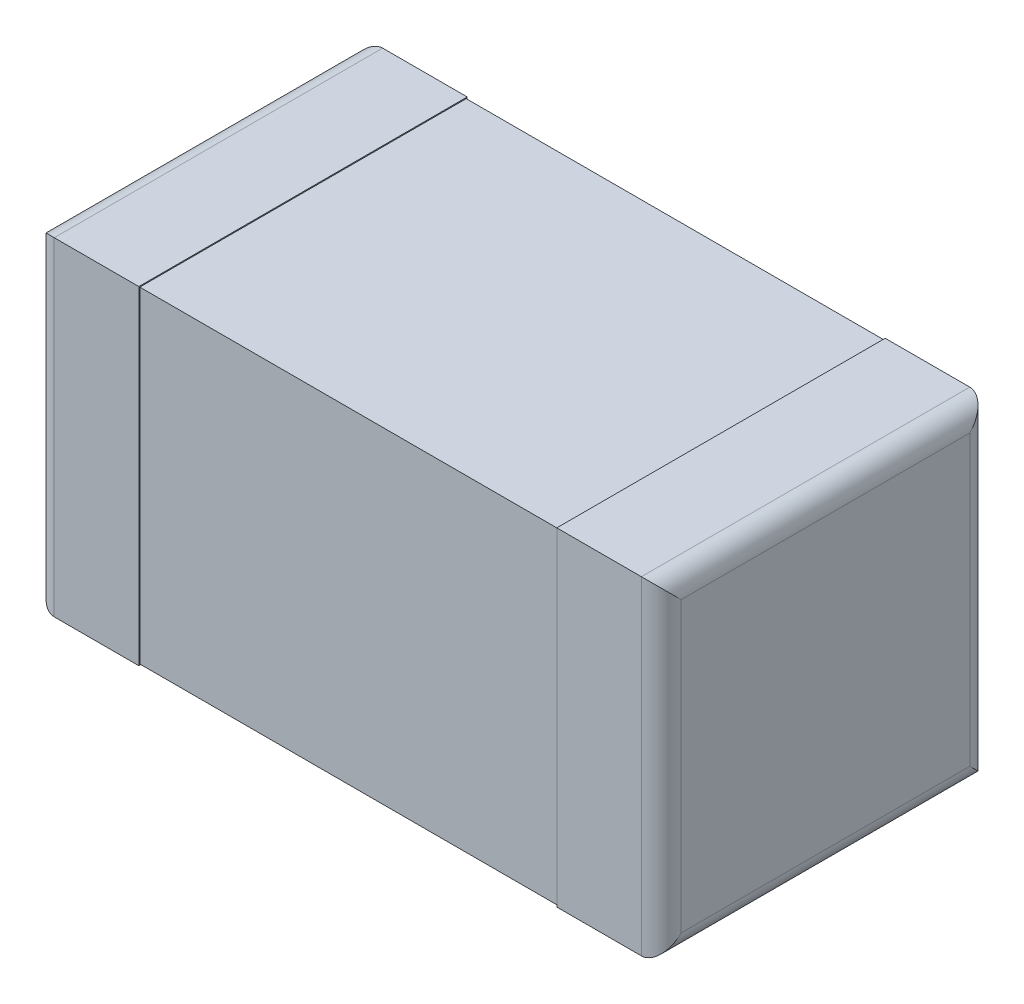
ISO-10303-21;
HEADER;
FILE_DESCRIPTION(('STEP AP214'),'2;1');
FILE_NAME('part.step','',(''),(''),'','','');
FILE_SCHEMA(('AUTOMOTIVE_DESIGN { 1 0 10303 214 1 1 1 1 }'));
ENDSEC;
DATA;
#1=APPLICATION_CONTEXT('core data for automotive mechanical design processes');
#2=APPLICATION_PROTOCOL_DEFINITION('international standard','automotive_design',2000,#1);
#3=PRODUCT_CONTEXT('',#1,'mechanical');
#4=PRODUCT('Part','Part','',(#3));
#5=PRODUCT_RELATED_PRODUCT_CATEGORY('part','',(#4));
#6=PRODUCT_DEFINITION_FORMATION('','',#4);
#7=PRODUCT_DEFINITION_CONTEXT('part definition',#1,'design');
#8=PRODUCT_DEFINITION('design','',#6,#7);
#9=PRODUCT_DEFINITION_SHAPE('','',#8);
#10=(LENGTH_UNIT() NAMED_UNIT(*) SI_UNIT(.MILLI.,.METRE.));
#11=(NAMED_UNIT(*) PLANE_ANGLE_UNIT() SI_UNIT($,.RADIAN.));
#12=(NAMED_UNIT(*) SI_UNIT($,.STERADIAN.) SOLID_ANGLE_UNIT());
#13=UNCERTAINTY_MEASURE_WITH_UNIT(LENGTH_MEASURE(1.E-05),#10,'distance_accuracy_value','');
#14=(GEOMETRIC_REPRESENTATION_CONTEXT(3) GLOBAL_UNCERTAINTY_ASSIGNED_CONTEXT((#13)) GLOBAL_UNIT_ASSIGNED_CONTEXT((#10,
#11,#12)) REPRESENTATION_CONTEXT('',''));
#15=CARTESIAN_POINT('',(0.,0.,0.));
#16=DIRECTION('',(0.,0.,1.));
#17=DIRECTION('',(1.,0.,0.));
#18=AXIS2_PLACEMENT_3D('',#15,#16,#17);
#19=CARTESIAN_POINT('',(0.,0.,0.));
#20=DIRECTION('',(0.,0.,1.));
#21=DIRECTION('',(1.,0.,0.));
#22=AXIS2_PLACEMENT_3D('',#19,#20,#21);
#23=PLANE('',#22);
#24=DIRECTION('',(-1.,0.,0.));
#25=VECTOR('',#24,1.);
#26=CARTESIAN_POINT('',(1.6002,0.8382,0.));
#27=LINE('',#26,#25);
#28=CARTESIAN_POINT('',(1.5494,0.8382,0.));
#29=VERTEX_POINT('',#28);
#30=CARTESIAN_POINT('',(1.3335,0.8382,0.));
#31=VERTEX_POINT('',#30);
#32=EDGE_CURVE('E42',#29,#31,#27,.T.);
#33=ORIENTED_EDGE('',*,*,#32,.F.);
#34=DIRECTION('',(0.,-1.,0.));
#35=VECTOR('',#34,1.);
#36=CARTESIAN_POINT('',(1.5494,0.,0.));
#37=LINE('',#36,#35);
#38=CARTESIAN_POINT('',(1.5494,0.,0.));
#39=VERTEX_POINT('',#38);
#40=EDGE_CURVE('E11',#29,#39,#37,.T.);
#41=ORIENTED_EDGE('',*,*,#40,.T.);
#42=DIRECTION('',(1.,0.,0.));
#43=VECTOR('',#42,1.);
#44=CARTESIAN_POINT('',(0.,0.,0.));
#45=LINE('',#44,#43);
#46=CARTESIAN_POINT('',(1.3335,0.,0.));
#47=VERTEX_POINT('',#46);
#48=EDGE_CURVE('E286',#47,#39,#45,.T.);
#49=ORIENTED_EDGE('',*,*,#48,.F.);
#50=DIRECTION('',(0.,1.,0.));
#51=VECTOR('',#50,1.);
#52=CARTESIAN_POINT('',(1.3335,0.,0.));
#53=LINE('',#52,#51);
#54=EDGE_CURVE('E29',#47,#31,#53,.T.);
#55=ORIENTED_EDGE('',*,*,#54,.T.);
#56=EDGE_LOOP('',(#33,#41,#49,#55));
#57=FACE_BOUND('',#56,.T.);
#58=ADVANCED_FACE('F18',(#57),#23,.F.);
#59=CARTESIAN_POINT('',(0.,0.,0.));
#60=DIRECTION('',(0.,0.,1.));
#61=DIRECTION('',(1.,0.,0.));
#62=AXIS2_PLACEMENT_3D('',#59,#60,#61);
#63=PLANE('',#62);
#64=DIRECTION('',(1.,0.,0.));
#65=VECTOR('',#64,1.);
#66=CARTESIAN_POINT('',(0.,0.,0.));
#67=LINE('',#66,#65);
#68=CARTESIAN_POINT('',(0.0508,0.,0.));
#69=VERTEX_POINT('',#68);
#70=CARTESIAN_POINT('',(0.2667,0.,0.));
#71=VERTEX_POINT('',#70);
#72=EDGE_CURVE('E339',#69,#71,#67,.T.);
#73=ORIENTED_EDGE('',*,*,#72,.F.);
#74=DIRECTION('',(0.,1.,0.));
#75=VECTOR('',#74,1.);
#76=CARTESIAN_POINT('',(0.0508,0.,0.));
#77=LINE('',#76,#75);
#78=CARTESIAN_POINT('',(0.0508,0.8382,0.));
#79=VERTEX_POINT('',#78);
#80=EDGE_CURVE('E355',#69,#79,#77,.T.);
#81=ORIENTED_EDGE('',*,*,#80,.T.);
#82=DIRECTION('',(-1.,0.,0.));
#83=VECTOR('',#82,1.);
#84=CARTESIAN_POINT('',(1.6002,0.8382,0.));
#85=LINE('',#84,#83);
#86=CARTESIAN_POINT('',(0.2667,0.8382,0.));
#87=VERTEX_POINT('',#86);
#88=EDGE_CURVE('E161',#87,#79,#85,.T.);
#89=ORIENTED_EDGE('',*,*,#88,.F.);
#90=DIRECTION('',(0.,-1.,0.));
#91=VECTOR('',#90,1.);
#92=CARTESIAN_POINT('',(0.2667,0.,0.));
#93=LINE('',#92,#91);
#94=EDGE_CURVE('E358',#87,#71,#93,.T.);
#95=ORIENTED_EDGE('',*,*,#94,.T.);
#96=EDGE_LOOP('',(#73,#81,#89,#95));
#97=FACE_BOUND('',#96,.T.);
#98=ADVANCED_FACE('F386',(#97),#63,.F.);
#99=CARTESIAN_POINT('',(1.3335,0.00254,-1.15577127423469));
#100=DIRECTION('',(0.,1.,0.));
#101=DIRECTION('',(1.,0.,0.));
#102=AXIS2_PLACEMENT_3D('',#99,#100,#101);
#103=PLANE('',#102);
#104=DIRECTION('',(-1.,0.,0.));
#105=VECTOR('',#104,1.);
#106=CARTESIAN_POINT('',(1.3335,0.00254,0.00253999999999988));
#107=LINE('',#106,#105);
#108=CARTESIAN_POINT('',(1.3335,0.00254000000000009,0.0025399999999999));
#109=VERTEX_POINT('',#108);
#110=CARTESIAN_POINT('',(0.2667,0.00254000000000009,0.0025399999999999));
#111=VERTEX_POINT('',#110);
#112=EDGE_CURVE('E231',#109,#111,#107,.T.);
#113=ORIENTED_EDGE('',*,*,#112,.F.);
#114=DIRECTION('',(0.,0.,1.));
#115=VECTOR('',#114,1.);
#116=CARTESIAN_POINT('',(1.3335,0.00254,-1.15577127423469));
#117=LINE('',#116,#115);
#118=CARTESIAN_POINT('',(1.3335,0.00254,0.83566));
#119=VERTEX_POINT('',#118);
#120=EDGE_CURVE('E191',#109,#119,#117,.T.);
#121=ORIENTED_EDGE('',*,*,#120,.T.);
#122=DIRECTION('',(-1.,0.,0.));
#123=VECTOR('',#122,1.);
#124=CARTESIAN_POINT('',(1.3335,0.00254,0.83566));
#125=LINE('',#124,#123);
#126=CARTESIAN_POINT('',(0.2667,0.00253999999999988,0.83566));
#127=VERTEX_POINT('',#126);
#128=EDGE_CURVE('E171',#119,#127,#125,.T.);
#129=ORIENTED_EDGE('',*,*,#128,.T.);
#130=DIRECTION('',(0.,0.,1.));
#131=VECTOR('',#130,1.);
#132=CARTESIAN_POINT('',(0.2667,0.00253999999999988,-1.15577127423469));
#133=LINE('',#132,#131);
#134=EDGE_CURVE('E179',#111,#127,#133,.T.);
#135=ORIENTED_EDGE('',*,*,#134,.F.);
#136=EDGE_LOOP('',(#113,#121,#129,#135));
#137=FACE_BOUND('',#136,.T.);
#138=ADVANCED_FACE('F189',(#137),#103,.F.);
#139=CARTESIAN_POINT('',(0.2667,0.83566,-1.15577127423469));
#140=DIRECTION('',(0.,-1.,0.));
#141=DIRECTION('',(0.,0.,-1.));
#142=AXIS2_PLACEMENT_3D('',#139,#140,#141);
#143=PLANE('',#142);
#144=DIRECTION('',(1.,0.,0.));
#145=VECTOR('',#144,1.);
#146=CARTESIAN_POINT('',(0.2667,0.83566,0.00253999999999988));
#147=LINE('',#146,#145);
#148=CARTESIAN_POINT('',(0.2667,0.83566,0.0025399999999999));
#149=VERTEX_POINT('',#148);
#150=CARTESIAN_POINT('',(1.3335,0.83566,0.0025399999999999));
#151=VERTEX_POINT('',#150);
#152=EDGE_CURVE('E218',#149,#151,#147,.T.);
#153=ORIENTED_EDGE('',*,*,#152,.F.);
#154=DIRECTION('',(0.,0.,1.));
#155=VECTOR('',#154,1.);
#156=CARTESIAN_POINT('',(0.2667,0.83566,-1.15577127423469));
#157=LINE('',#156,#155);
#158=CARTESIAN_POINT('',(0.2667,0.83566,0.83566));
#159=VERTEX_POINT('',#158);
#160=EDGE_CURVE('E194',#149,#159,#157,.T.);
#161=ORIENTED_EDGE('',*,*,#160,.T.);
#162=DIRECTION('',(1.,0.,0.));
#163=VECTOR('',#162,1.);
#164=CARTESIAN_POINT('',(0.2667,0.83566,0.83566));
#165=LINE('',#164,#163);
#166=CARTESIAN_POINT('',(1.3335,0.83566,0.83566));
#167=VERTEX_POINT('',#166);
#168=EDGE_CURVE('E198',#159,#167,#165,.T.);
#169=ORIENTED_EDGE('',*,*,#168,.T.);
#170=DIRECTION('',(0.,0.,1.));
#171=VECTOR('',#170,1.);
#172=CARTESIAN_POINT('',(1.3335,0.83566,-1.15577127423469));
#173=LINE('',#172,#171);
#174=EDGE_CURVE('E207',#151,#167,#173,.T.);
#175=ORIENTED_EDGE('',*,*,#174,.F.);
#176=EDGE_LOOP('',(#153,#161,#169,#175));
#177=FACE_BOUND('',#176,.T.);
#178=ADVANCED_FACE('F257',(#177),#143,.F.);
#179=CARTESIAN_POINT('',(1.6002,0.8382,0.8382));
#180=DIRECTION('',(0.,-1.,0.));
#181=DIRECTION('',(0.,0.,-1.));
#182=AXIS2_PLACEMENT_3D('',#179,#180,#181);
#183=PLANE('',#182);
#184=DIRECTION('',(-1.,0.,0.));
#185=VECTOR('',#184,1.);
#186=CARTESIAN_POINT('',(1.6002,0.8382,0.8382));
#187=LINE('',#186,#185);
#188=CARTESIAN_POINT('',(1.5494,0.8382,0.8382));
#189=VERTEX_POINT('',#188);
#190=CARTESIAN_POINT('',(1.3335,0.8382,0.8382));
#191=VERTEX_POINT('',#190);
#192=EDGE_CURVE('E230',#189,#191,#187,.T.);
#193=ORIENTED_EDGE('',*,*,#192,.F.);
#194=DIRECTION('',(0.,0.,-1.));
#195=VECTOR('',#194,1.);
#196=CARTESIAN_POINT('',(1.5494,0.8382,0.8382));
#197=LINE('',#196,#195);
#198=EDGE_CURVE('E237',#189,#29,#197,.T.);
#199=ORIENTED_EDGE('',*,*,#198,.T.);
#200=ORIENTED_EDGE('',*,*,#32,.T.);
#201=DIRECTION('',(0.,0.,1.));
#202=VECTOR('',#201,1.);
#203=CARTESIAN_POINT('',(1.3335,0.8382,0.83566));
#204=LINE('',#203,#202);
#205=EDGE_CURVE('E300',#31,#191,#204,.T.);
#206=ORIENTED_EDGE('',*,*,#205,.T.);
#207=EDGE_LOOP('',(#193,#199,#200,#206));
#208=FACE_BOUND('',#207,.T.);
#209=ADVANCED_FACE('F425',(#208),#183,.F.);
#210=CARTESIAN_POINT('',(0.,0.,0.8382));
#211=DIRECTION('',(0.,1.,0.));
#212=DIRECTION('',(1.,0.,0.));
#213=AXIS2_PLACEMENT_3D('',#210,#211,#212);
#214=PLANE('',#213);
#215=DIRECTION('',(1.,0.,0.));
#216=VECTOR('',#215,1.);
#217=CARTESIAN_POINT('',(0.,0.,0.8382));
#218=LINE('',#217,#216);
#219=CARTESIAN_POINT('',(0.0508,0.,0.8382));
#220=VERTEX_POINT('',#219);
#221=CARTESIAN_POINT('',(0.2667,0.,0.8382));
#222=VERTEX_POINT('',#221);
#223=EDGE_CURVE('E293',#220,#222,#218,.T.);
#224=ORIENTED_EDGE('',*,*,#223,.F.);
#225=DIRECTION('',(0.,0.,-1.));
#226=VECTOR('',#225,1.);
#227=CARTESIAN_POINT('',(0.0508,0.,0.8382));
#228=LINE('',#227,#226);
#229=EDGE_CURVE('E304',#220,#69,#228,.T.);
#230=ORIENTED_EDGE('',*,*,#229,.T.);
#231=ORIENTED_EDGE('',*,*,#72,.T.);
#232=DIRECTION('',(0.,0.,1.));
#233=VECTOR('',#232,1.);
#234=CARTESIAN_POINT('',(0.2667,0.,0.83566));
#235=LINE('',#234,#233);
#236=EDGE_CURVE('E332',#71,#222,#235,.T.);
#237=ORIENTED_EDGE('',*,*,#236,.T.);
#238=EDGE_LOOP('',(#224,#230,#231,#237));
#239=FACE_BOUND('',#238,.T.);
#240=ADVANCED_FACE('F390',(#239),#214,.F.);
#241=CARTESIAN_POINT('',(0.,0.,0.8382));
#242=DIRECTION('',(0.,1.,0.));
#243=DIRECTION('',(1.,0.,0.));
#244=AXIS2_PLACEMENT_3D('',#241,#242,#243);
#245=PLANE('',#244);
#246=ORIENTED_EDGE('',*,*,#48,.T.);
#247=DIRECTION('',(0.,0.,1.));
#248=VECTOR('',#247,1.);
#249=CARTESIAN_POINT('',(1.5494,0.,0.8382));
#250=LINE('',#249,#248);
#251=CARTESIAN_POINT('',(1.5494,0.,0.8382));
#252=VERTEX_POINT('',#251);
#253=EDGE_CURVE('E282',#39,#252,#250,.T.);
#254=ORIENTED_EDGE('',*,*,#253,.T.);
#255=DIRECTION('',(1.,0.,0.));
#256=VECTOR('',#255,1.);
#257=CARTESIAN_POINT('',(0.,0.,0.8382));
#258=LINE('',#257,#256);
#259=CARTESIAN_POINT('',(1.3335,0.,0.8382));
#260=VERTEX_POINT('',#259);
#261=EDGE_CURVE('E229',#260,#252,#258,.T.);
#262=ORIENTED_EDGE('',*,*,#261,.F.);
#263=DIRECTION('',(0.,0.,1.));
#264=VECTOR('',#263,1.);
#265=CARTESIAN_POINT('',(1.3335,0.,0.83566));
#266=LINE('',#265,#264);
#267=EDGE_CURVE('E234',#47,#260,#266,.T.);
#268=ORIENTED_EDGE('',*,*,#267,.F.);
#269=EDGE_LOOP('',(#246,#254,#262,#268));
#270=FACE_BOUND('',#269,.T.);
#271=ADVANCED_FACE('F424',(#270),#245,.F.);
#272=CARTESIAN_POINT('',(1.6002,0.8382,0.8382));
#273=DIRECTION('',(0.,-1.,0.));
#274=DIRECTION('',(0.,0.,-1.));
#275=AXIS2_PLACEMENT_3D('',#272,#273,#274);
#276=PLANE('',#275);
#277=ORIENTED_EDGE('',*,*,#88,.T.);
#278=DIRECTION('',(0.,0.,1.));
#279=VECTOR('',#278,1.);
#280=CARTESIAN_POINT('',(0.0508,0.8382,0.8382));
#281=LINE('',#280,#279);
#282=CARTESIAN_POINT('',(0.0508,0.8382,0.8382));
#283=VERTEX_POINT('',#282);
#284=EDGE_CURVE('E147',#79,#283,#281,.T.);
#285=ORIENTED_EDGE('',*,*,#284,.T.);
#286=DIRECTION('',(-1.,0.,0.));
#287=VECTOR('',#286,1.);
#288=CARTESIAN_POINT('',(1.6002,0.8382,0.8382));
#289=LINE('',#288,#287);
#290=CARTESIAN_POINT('',(0.2667,0.8382,0.8382));
#291=VERTEX_POINT('',#290);
#292=EDGE_CURVE('E238',#291,#283,#289,.T.);
#293=ORIENTED_EDGE('',*,*,#292,.F.);
#294=DIRECTION('',(0.,0.,1.));
#295=VECTOR('',#294,1.);
#296=CARTESIAN_POINT('',(0.2667,0.8382,0.83566));
#297=LINE('',#296,#295);
#298=EDGE_CURVE('E201',#87,#291,#297,.T.);
#299=ORIENTED_EDGE('',*,*,#298,.F.);
#300=EDGE_LOOP('',(#277,#285,#293,#299));
#301=FACE_BOUND('',#300,.T.);
#302=ADVANCED_FACE('F20',(#301),#276,.F.);
#303=CARTESIAN_POINT('',(0.,0.,0.8382));
#304=DIRECTION('',(0.,0.,1.));
#305=DIRECTION('',(1.,0.,0.));
#306=AXIS2_PLACEMENT_3D('',#303,#304,#305);
#307=PLANE('',#306);
#308=ORIENTED_EDGE('',*,*,#292,.T.);
#309=DIRECTION('',(0.,-1.,0.));
#310=VECTOR('',#309,1.);
#311=CARTESIAN_POINT('',(0.0508,0.,0.8382));
#312=LINE('',#311,#310);
#313=EDGE_CURVE('E242',#283,#220,#312,.T.);
#314=ORIENTED_EDGE('',*,*,#313,.T.);
#315=ORIENTED_EDGE('',*,*,#223,.T.);
#316=DIRECTION('',(0.,1.,0.));
#317=VECTOR('',#316,1.);
#318=CARTESIAN_POINT('',(0.2667,0.,0.8382));
#319=LINE('',#318,#317);
#320=EDGE_CURVE('E251',#222,#291,#319,.T.);
#321=ORIENTED_EDGE('',*,*,#320,.T.);
#322=EDGE_LOOP('',(#308,#314,#315,#321));
#323=FACE_BOUND('',#322,.T.);
#324=ADVANCED_FACE('F392',(#323),#307,.T.);
#325=CARTESIAN_POINT('',(0.,0.,0.8382));
#326=DIRECTION('',(0.,0.,1.));
#327=DIRECTION('',(1.,0.,0.));
#328=AXIS2_PLACEMENT_3D('',#325,#326,#327);
#329=PLANE('',#328);
#330=ORIENTED_EDGE('',*,*,#261,.T.);
#331=DIRECTION('',(0.,1.,0.));
#332=VECTOR('',#331,1.);
#333=CARTESIAN_POINT('',(1.5494,0.8382,0.8382));
#334=LINE('',#333,#332);
#335=EDGE_CURVE('E225',#252,#189,#334,.T.);
#336=ORIENTED_EDGE('',*,*,#335,.T.);
#337=ORIENTED_EDGE('',*,*,#192,.T.);
#338=DIRECTION('',(0.,-1.,0.));
#339=VECTOR('',#338,1.);
#340=CARTESIAN_POINT('',(1.3335,0.8382,0.8382));
#341=LINE('',#340,#339);
#342=EDGE_CURVE('E278',#191,#260,#341,.T.);
#343=ORIENTED_EDGE('',*,*,#342,.T.);
#344=EDGE_LOOP('',(#330,#336,#337,#343));
#345=FACE_BOUND('',#344,.T.);
#346=ADVANCED_FACE('F431',(#345),#329,.T.);
#347=CARTESIAN_POINT('',(0.,0.8382,0.8382));
#348=DIRECTION('',(1.,0.,0.));
#349=DIRECTION('',(0.,1.,0.));
#350=AXIS2_PLACEMENT_3D('',#347,#348,#349);
#351=PLANE('',#350);
#352=DIRECTION('',(0.,-1.,0.));
#353=VECTOR('',#352,1.);
#354=CARTESIAN_POINT('',(0.,0.8382,0.0508));
#355=LINE('',#354,#353);
#356=CARTESIAN_POINT('',(0.,0.7874,0.0508));
#357=VERTEX_POINT('',#356);
#358=CARTESIAN_POINT('',(0.,0.0508,0.0508));
#359=VERTEX_POINT('',#358);
#360=EDGE_CURVE('E22',#357,#359,#355,.T.);
#361=ORIENTED_EDGE('',*,*,#360,.T.);
#362=DIRECTION('',(0.,0.,1.));
#363=VECTOR('',#362,1.);
#364=CARTESIAN_POINT('',(0.,0.0508,0.8382));
#365=LINE('',#364,#363);
#366=CARTESIAN_POINT('',(0.,0.0508,0.7874));
#367=VERTEX_POINT('',#366);
#368=EDGE_CURVE('E295',#359,#367,#365,.T.);
#369=ORIENTED_EDGE('',*,*,#368,.T.);
#370=DIRECTION('',(0.,1.,0.));
#371=VECTOR('',#370,1.);
#372=CARTESIAN_POINT('',(0.,0.8382,0.7874));
#373=LINE('',#372,#371);
#374=CARTESIAN_POINT('',(0.,0.7874,0.7874));
#375=VERTEX_POINT('',#374);
#376=EDGE_CURVE('E299',#367,#375,#373,.T.);
#377=ORIENTED_EDGE('',*,*,#376,.T.);
#378=DIRECTION('',(0.,0.,-1.));
#379=VECTOR('',#378,1.);
#380=CARTESIAN_POINT('',(0.,0.7874,0.8382));
#381=LINE('',#380,#379);
#382=EDGE_CURVE('E336',#375,#357,#381,.T.);
#383=ORIENTED_EDGE('',*,*,#382,.T.);
#384=EDGE_LOOP('',(#361,#369,#377,#383));
#385=FACE_BOUND('',#384,.T.);
#386=ADVANCED_FACE('F381',(#385),#351,.F.);
#387=CARTESIAN_POINT('',(1.6002,0.,0.8382));
#388=DIRECTION('',(-1.,0.,0.));
#389=DIRECTION('',(0.,0.,1.));
#390=AXIS2_PLACEMENT_3D('',#387,#388,#389);
#391=PLANE('',#390);
#392=DIRECTION('',(0.,1.,0.));
#393=VECTOR('',#392,1.);
#394=CARTESIAN_POINT('',(1.6002,0.,0.0508));
#395=LINE('',#394,#393);
#396=CARTESIAN_POINT('',(1.6002,0.0508,0.0508));
#397=VERTEX_POINT('',#396);
#398=CARTESIAN_POINT('',(1.6002,0.7874,0.0508));
#399=VERTEX_POINT('',#398);
#400=EDGE_CURVE('E247',#397,#399,#395,.T.);
#401=ORIENTED_EDGE('',*,*,#400,.T.);
#402=DIRECTION('',(0.,0.,1.));
#403=VECTOR('',#402,1.);
#404=CARTESIAN_POINT('',(1.6002,0.7874,0.8382));
#405=LINE('',#404,#403);
#406=CARTESIAN_POINT('',(1.6002,0.7874,0.7874));
#407=VERTEX_POINT('',#406);
#408=EDGE_CURVE('E243',#399,#407,#405,.T.);
#409=ORIENTED_EDGE('',*,*,#408,.T.);
#410=DIRECTION('',(0.,-1.,0.));
#411=VECTOR('',#410,1.);
#412=CARTESIAN_POINT('',(1.6002,0.,0.7874));
#413=LINE('',#412,#411);
#414=CARTESIAN_POINT('',(1.6002,0.0508,0.7874));
#415=VERTEX_POINT('',#414);
#416=EDGE_CURVE('E248',#407,#415,#413,.T.);
#417=ORIENTED_EDGE('',*,*,#416,.T.);
#418=DIRECTION('',(0.,0.,-1.));
#419=VECTOR('',#418,1.);
#420=CARTESIAN_POINT('',(1.6002,0.0508,0.8382));
#421=LINE('',#420,#419);
#422=EDGE_CURVE('E261',#415,#397,#421,.T.);
#423=ORIENTED_EDGE('',*,*,#422,.T.);
#424=EDGE_LOOP('',(#401,#409,#417,#423));
#425=FACE_BOUND('',#424,.T.);
#426=ADVANCED_FACE('F434',(#425),#391,.F.);
#427=CARTESIAN_POINT('',(0.2667,0.,0.83566));
#428=DIRECTION('',(1.,0.,0.));
#429=DIRECTION('',(0.,1.,0.));
#430=AXIS2_PLACEMENT_3D('',#427,#428,#429);
#431=PLANE('',#430);
#432=ORIENTED_EDGE('',*,*,#160,.F.);
#433=DIRECTION('',(0.,-1.,0.));
#434=VECTOR('',#433,1.);
#435=CARTESIAN_POINT('',(0.2667,1.99143127423469,0.0025399999999999));
#436=LINE('',#435,#434);
#437=EDGE_CURVE('E185',#149,#111,#436,.T.);
#438=ORIENTED_EDGE('',*,*,#437,.T.);
#439=ORIENTED_EDGE('',*,*,#134,.T.);
#440=DIRECTION('',(0.,1.,0.));
#441=VECTOR('',#440,1.);
#442=CARTESIAN_POINT('',(0.2667,0.,0.83566));
#443=LINE('',#442,#441);
#444=EDGE_CURVE('E183',#127,#159,#443,.T.);
#445=ORIENTED_EDGE('',*,*,#444,.T.);
#446=EDGE_LOOP('',(#432,#438,#439,#445));
#447=FACE_BOUND('',#446,.T.);
#448=ORIENTED_EDGE('',*,*,#298,.T.);
#449=ORIENTED_EDGE('',*,*,#320,.F.);
#450=ORIENTED_EDGE('',*,*,#236,.F.);
#451=ORIENTED_EDGE('',*,*,#94,.F.);
#452=EDGE_LOOP('',(#448,#449,#450,#451));
#453=FACE_BOUND('',#452,.T.);
#454=ADVANCED_FACE('F181',(#447,#453),#431,.T.);
#455=CARTESIAN_POINT('',(1.3335,0.8382,0.83566));
#456=DIRECTION('',(-1.,0.,0.));
#457=DIRECTION('',(0.,0.,1.));
#458=AXIS2_PLACEMENT_3D('',#455,#456,#457);
#459=PLANE('',#458);
#460=DIRECTION('',(0.,-1.,0.));
#461=VECTOR('',#460,1.);
#462=CARTESIAN_POINT('',(1.3335,1.99143127423469,0.0025399999999999));
#463=LINE('',#462,#461);
#464=EDGE_CURVE('E214',#151,#109,#463,.T.);
#465=ORIENTED_EDGE('',*,*,#464,.F.);
#466=ORIENTED_EDGE('',*,*,#174,.T.);
#467=DIRECTION('',(0.,-1.,0.));
#468=VECTOR('',#467,1.);
#469=CARTESIAN_POINT('',(1.3335,0.8382,0.83566));
#470=LINE('',#469,#468);
#471=EDGE_CURVE('E213',#167,#119,#470,.T.);
#472=ORIENTED_EDGE('',*,*,#471,.T.);
#473=ORIENTED_EDGE('',*,*,#120,.F.);
#474=EDGE_LOOP('',(#465,#466,#472,#473));
#475=FACE_BOUND('',#474,.T.);
#476=ORIENTED_EDGE('',*,*,#267,.T.);
#477=ORIENTED_EDGE('',*,*,#342,.F.);
#478=ORIENTED_EDGE('',*,*,#205,.F.);
#479=ORIENTED_EDGE('',*,*,#54,.F.);
#480=EDGE_LOOP('',(#476,#477,#478,#479));
#481=FACE_BOUND('',#480,.T.);
#482=ADVANCED_FACE('F418',(#475,#481),#459,.T.);
#483=CARTESIAN_POINT('',(0.,0.,0.83566));
#484=DIRECTION('',(0.,0.,-1.));
#485=DIRECTION('',(0.,-1.,0.));
#486=AXIS2_PLACEMENT_3D('',#483,#484,#485);
#487=PLANE('',#486);
#488=ORIENTED_EDGE('',*,*,#471,.F.);
#489=ORIENTED_EDGE('',*,*,#168,.F.);
#490=ORIENTED_EDGE('',*,*,#444,.F.);
#491=ORIENTED_EDGE('',*,*,#128,.F.);
#492=EDGE_LOOP('',(#488,#489,#490,#491));
#493=FACE_BOUND('',#492,.T.);
#494=ADVANCED_FACE('F196',(#493),#487,.F.);
#495=CARTESIAN_POINT('',(0.2667,1.99143127423469,0.0025399999999999));
#496=DIRECTION('',(0.,0.,-1.));
#497=DIRECTION('',(0.,-1.,0.));
#498=AXIS2_PLACEMENT_3D('',#495,#496,#497);
#499=PLANE('',#498);
#500=ORIENTED_EDGE('',*,*,#112,.T.);
#501=ORIENTED_EDGE('',*,*,#437,.F.);
#502=ORIENTED_EDGE('',*,*,#152,.T.);
#503=ORIENTED_EDGE('',*,*,#464,.T.);
#504=EDGE_LOOP('',(#500,#501,#502,#503));
#505=FACE_BOUND('',#504,.T.);
#506=ADVANCED_FACE('F260',(#505),#499,.T.);
#507=CARTESIAN_POINT('',(0.0508,0.7874,0.8382));
#508=DIRECTION('',(0.,0.,-1.));
#509=DIRECTION('',(-1.,0.,0.));
#510=AXIS2_PLACEMENT_3D('',#507,#508,#509);
#511=CYLINDRICAL_SURFACE('',#510,0.0508);
#512=CARTESIAN_POINT('',(0.0508,0.7874,0.0508));
#513=DIRECTION('',(0.,-0.707106781186548,-0.707106781186548));
#514=DIRECTION('',(0.,0.707106781186548,-0.707106781186548));
#515=AXIS2_PLACEMENT_3D('',#512,#513,#514);
#516=ELLIPSE('',#515,0.0718420489685533,0.0508);
#517=EDGE_CURVE('E220',#357,#79,#516,.T.);
#518=ORIENTED_EDGE('',*,*,#517,.F.);
#519=ORIENTED_EDGE('',*,*,#382,.F.);
#520=CARTESIAN_POINT('',(0.0508,0.7874,0.7874));
#521=DIRECTION('',(0.,-0.707106781186548,0.707106781186548));
#522=DIRECTION('',(0.,-0.707106781186548,-0.707106781186548));
#523=AXIS2_PLACEMENT_3D('',#520,#521,#522);
#524=ELLIPSE('',#523,0.0718420489685533,0.0508);
#525=EDGE_CURVE('E219',#283,#375,#524,.T.);
#526=ORIENTED_EDGE('',*,*,#525,.F.);
#527=ORIENTED_EDGE('',*,*,#284,.F.);
#528=EDGE_LOOP('',(#518,#519,#526,#527));
#529=FACE_BOUND('',#528,.T.);
#530=ADVANCED_FACE('F397',(#529),#511,.T.);
#531=CARTESIAN_POINT('',(0.0508,0.,0.7874));
#532=DIRECTION('',(0.,1.,0.));
#533=DIRECTION('',(-1.,0.,0.));
#534=AXIS2_PLACEMENT_3D('',#531,#532,#533);
#535=CYLINDRICAL_SURFACE('',#534,0.0508);
#536=ORIENTED_EDGE('',*,*,#525,.T.);
#537=ORIENTED_EDGE('',*,*,#376,.F.);
#538=CARTESIAN_POINT('',(0.0508,0.0508,0.7874));
#539=DIRECTION('',(0.,-0.707106781186548,-0.707106781186548));
#540=DIRECTION('',(0.,0.707106781186548,-0.707106781186548));
#541=AXIS2_PLACEMENT_3D('',#538,#539,#540);
#542=ELLIPSE('',#541,0.0718420489685533,0.0508);
#543=EDGE_CURVE('E224',#220,#367,#542,.T.);
#544=ORIENTED_EDGE('',*,*,#543,.F.);
#545=ORIENTED_EDGE('',*,*,#313,.F.);
#546=EDGE_LOOP('',(#536,#537,#544,#545));
#547=FACE_BOUND('',#546,.T.);
#548=ADVANCED_FACE('F376',(#547),#535,.T.);
#549=CARTESIAN_POINT('',(0.0508,0.8382,0.0508));
#550=DIRECTION('',(0.,-1.,0.));
#551=DIRECTION('',(1.,0.,0.));
#552=AXIS2_PLACEMENT_3D('',#549,#550,#551);
#553=CYLINDRICAL_SURFACE('',#552,0.0508);
#554=ORIENTED_EDGE('',*,*,#517,.T.);
#555=ORIENTED_EDGE('',*,*,#80,.F.);
#556=CARTESIAN_POINT('',(0.0508,0.0508,0.0508));
#557=DIRECTION('',(0.,-0.707106781186548,0.707106781186548));
#558=DIRECTION('',(0.,-0.707106781186548,-0.707106781186548));
#559=AXIS2_PLACEMENT_3D('',#556,#557,#558);
#560=ELLIPSE('',#559,0.0718420489685533,0.0508);
#561=EDGE_CURVE('E319',#359,#69,#560,.T.);
#562=ORIENTED_EDGE('',*,*,#561,.F.);
#563=ORIENTED_EDGE('',*,*,#360,.F.);
#564=EDGE_LOOP('',(#554,#555,#562,#563));
#565=FACE_BOUND('',#564,.T.);
#566=ADVANCED_FACE('F385',(#565),#553,.T.);
#567=CARTESIAN_POINT('',(0.0508,0.0508,0.8382));
#568=DIRECTION('',(0.,0.,-1.));
#569=DIRECTION('',(-1.,0.,0.));
#570=AXIS2_PLACEMENT_3D('',#567,#568,#569);
#571=CYLINDRICAL_SURFACE('',#570,0.0508);
#572=ORIENTED_EDGE('',*,*,#543,.T.);
#573=ORIENTED_EDGE('',*,*,#368,.F.);
#574=ORIENTED_EDGE('',*,*,#561,.T.);
#575=ORIENTED_EDGE('',*,*,#229,.F.);
#576=EDGE_LOOP('',(#572,#573,#574,#575));
#577=FACE_BOUND('',#576,.T.);
#578=ADVANCED_FACE('F372',(#577),#571,.T.);
#579=CARTESIAN_POINT('',(1.5494,0.0508,0.8382));
#580=DIRECTION('',(0.,0.,-1.));
#581=DIRECTION('',(-1.,0.,0.));
#582=AXIS2_PLACEMENT_3D('',#579,#580,#581);
#583=CYLINDRICAL_SURFACE('',#582,0.0508);
#584=CARTESIAN_POINT('',(1.5494,0.0508,0.0508));
#585=DIRECTION('',(0.,0.707106781186548,-0.707106781186548));
#586=DIRECTION('',(0.,-0.707106781186548,-0.707106781186548));
#587=AXIS2_PLACEMENT_3D('',#584,#585,#586);
#588=ELLIPSE('',#587,0.0718420489685533,0.0508);
#589=EDGE_CURVE('E309',#397,#39,#588,.T.);
#590=ORIENTED_EDGE('',*,*,#589,.F.);
#591=ORIENTED_EDGE('',*,*,#422,.F.);
#592=CARTESIAN_POINT('',(1.5494,0.0508,0.7874));
#593=DIRECTION('',(0.,0.707106781186548,0.707106781186548));
#594=DIRECTION('',(0.,0.707106781186548,-0.707106781186548));
#595=AXIS2_PLACEMENT_3D('',#592,#593,#594);
#596=ELLIPSE('',#595,0.0718420489685533,0.0508);
#597=EDGE_CURVE('E313',#252,#415,#596,.T.);
#598=ORIENTED_EDGE('',*,*,#597,.F.);
#599=ORIENTED_EDGE('',*,*,#253,.F.);
#600=EDGE_LOOP('',(#590,#591,#598,#599));
#601=FACE_BOUND('',#600,.T.);
#602=ADVANCED_FACE('F426',(#601),#583,.T.);
#603=CARTESIAN_POINT('',(1.5494,0.,0.7874));
#604=DIRECTION('',(0.,-1.,0.));
#605=DIRECTION('',(0.,0.,-1.));
#606=AXIS2_PLACEMENT_3D('',#603,#604,#605);
#607=CYLINDRICAL_SURFACE('',#606,0.0508);
#608=ORIENTED_EDGE('',*,*,#597,.T.);
#609=ORIENTED_EDGE('',*,*,#416,.F.);
#610=CARTESIAN_POINT('',(1.5494,0.7874,0.7874));
#611=DIRECTION('',(0.,0.707106781186548,-0.707106781186548));
#612=DIRECTION('',(0.,-0.707106781186548,-0.707106781186548));
#613=AXIS2_PLACEMENT_3D('',#610,#611,#612);
#614=ELLIPSE('',#613,0.0718420489685533,0.0508);
#615=EDGE_CURVE('E314',#189,#407,#614,.T.);
#616=ORIENTED_EDGE('',*,*,#615,.F.);
#617=ORIENTED_EDGE('',*,*,#335,.F.);
#618=EDGE_LOOP('',(#608,#609,#616,#617));
#619=FACE_BOUND('',#618,.T.);
#620=ADVANCED_FACE('F428',(#619),#607,.T.);
#621=CARTESIAN_POINT('',(1.5494,0.,0.0508));
#622=DIRECTION('',(0.,1.,0.));
#623=DIRECTION('',(0.,0.,1.));
#624=AXIS2_PLACEMENT_3D('',#621,#622,#623);
#625=CYLINDRICAL_SURFACE('',#624,0.0508);
#626=ORIENTED_EDGE('',*,*,#589,.T.);
#627=ORIENTED_EDGE('',*,*,#40,.F.);
#628=CARTESIAN_POINT('',(1.5494,0.7874,0.0508));
#629=DIRECTION('',(0.,0.707106781186548,0.707106781186548));
#630=DIRECTION('',(0.,0.707106781186548,-0.707106781186548));
#631=AXIS2_PLACEMENT_3D('',#628,#629,#630);
#632=ELLIPSE('',#631,0.0718420489685533,0.0508);
#633=EDGE_CURVE('E326',#399,#29,#632,.T.);
#634=ORIENTED_EDGE('',*,*,#633,.F.);
#635=ORIENTED_EDGE('',*,*,#400,.F.);
#636=EDGE_LOOP('',(#626,#627,#634,#635));
#637=FACE_BOUND('',#636,.T.);
#638=ADVANCED_FACE('F417',(#637),#625,.T.);
#639=CARTESIAN_POINT('',(1.5494,0.7874,0.8382));
#640=DIRECTION('',(0.,0.,-1.));
#641=DIRECTION('',(-1.,0.,0.));
#642=AXIS2_PLACEMENT_3D('',#639,#640,#641);
#643=CYLINDRICAL_SURFACE('',#642,0.0508);
#644=ORIENTED_EDGE('',*,*,#615,.T.);
#645=ORIENTED_EDGE('',*,*,#408,.F.);
#646=ORIENTED_EDGE('',*,*,#633,.T.);
#647=ORIENTED_EDGE('',*,*,#198,.F.);
#648=EDGE_LOOP('',(#644,#645,#646,#647));
#649=FACE_BOUND('',#648,.T.);
#650=ADVANCED_FACE('F448',(#649),#643,.T.);
#651=CLOSED_SHELL('',(#58,#98,#138,#178,#209,#240,#271,#302,#324,#346,#386,#426,#454,#482,#494,
#506,#530,#548,#566,#578,#602,#620,#638,#650));
#652=MANIFOLD_SOLID_BREP('B1',#651);
#653=ADVANCED_BREP_SHAPE_REPRESENTATION('',(#18,#652),#14);
#654=SHAPE_DEFINITION_REPRESENTATION(#9,#653);
ENDSEC;
END-ISO-10303-21;
